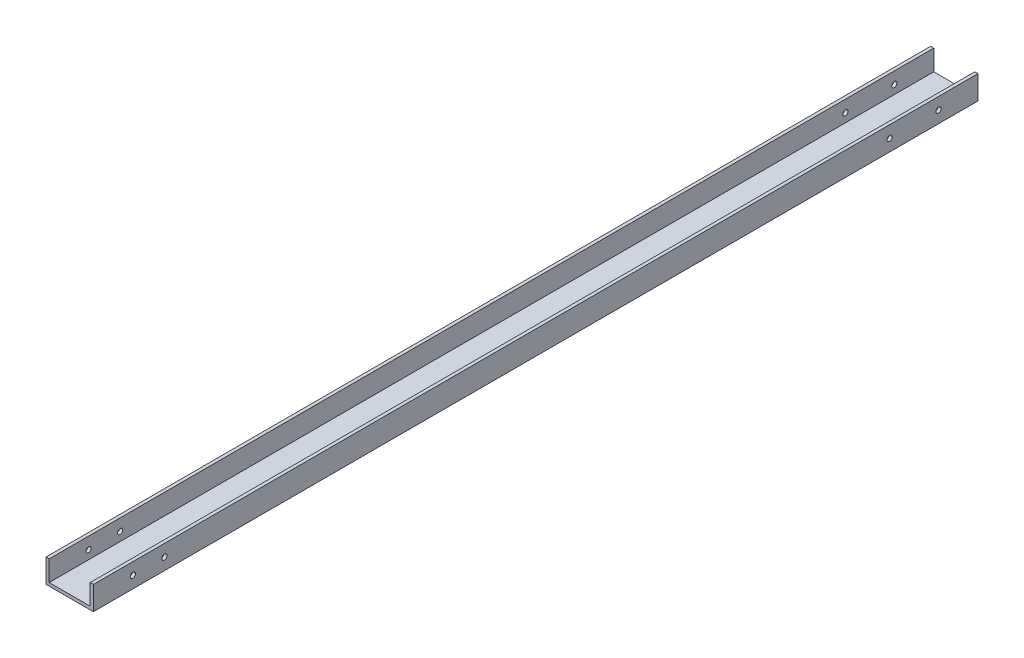
ISO-10303-21;
HEADER;
FILE_DESCRIPTION(('STEP AP214'),'2;1');
FILE_NAME('part.step','',(''),(''),'','','');
FILE_SCHEMA(('AUTOMOTIVE_DESIGN { 1 0 10303 214 1 1 1 1 }'));
ENDSEC;
DATA;
#1=APPLICATION_CONTEXT('core data for automotive mechanical design processes');
#2=APPLICATION_PROTOCOL_DEFINITION('international standard','automotive_design',2000,#1);
#3=PRODUCT_CONTEXT('',#1,'mechanical');
#4=PRODUCT('Part','Part','',(#3));
#5=PRODUCT_RELATED_PRODUCT_CATEGORY('part','',(#4));
#6=PRODUCT_DEFINITION_FORMATION('','',#4);
#7=PRODUCT_DEFINITION_CONTEXT('part definition',#1,'design');
#8=PRODUCT_DEFINITION('design','',#6,#7);
#9=PRODUCT_DEFINITION_SHAPE('','',#8);
#10=(LENGTH_UNIT() NAMED_UNIT(*) SI_UNIT(.MILLI.,.METRE.));
#11=(NAMED_UNIT(*) PLANE_ANGLE_UNIT() SI_UNIT($,.RADIAN.));
#12=(NAMED_UNIT(*) SI_UNIT($,.STERADIAN.) SOLID_ANGLE_UNIT());
#13=UNCERTAINTY_MEASURE_WITH_UNIT(LENGTH_MEASURE(1.E-05),#10,'distance_accuracy_value','');
#14=(GEOMETRIC_REPRESENTATION_CONTEXT(3) GLOBAL_UNCERTAINTY_ASSIGNED_CONTEXT((#13)) GLOBAL_UNIT_ASSIGNED_CONTEXT((#10,
#11,#12)) REPRESENTATION_CONTEXT('',''));
#15=CARTESIAN_POINT('',(0.,0.,0.));
#16=DIRECTION('',(0.,0.,1.));
#17=DIRECTION('',(1.,0.,0.));
#18=AXIS2_PLACEMENT_3D('',#15,#16,#17);
#19=CARTESIAN_POINT('',(-15.,0.,560.3));
#20=DIRECTION('',(1.,0.,0.));
#21=DIRECTION('',(0.,0.,-1.));
#22=AXIS2_PLACEMENT_3D('',#19,#20,#21);
#23=PLANE('',#22);
#24=CARTESIAN_POINT('',(-15.,7.5,25.));
#25=DIRECTION('',(-1.,0.,0.));
#26=DIRECTION('',(0.,0.,1.));
#27=AXIS2_PLACEMENT_3D('',#24,#25,#26);
#28=CIRCLE('',#27,1.64999999999999);
#29=CARTESIAN_POINT('',(-15.,7.5,26.65));
#30=VERTEX_POINT('',#29);
#31=EDGE_CURVE('E219',#30,#30,#28,.T.);
#32=ORIENTED_EDGE('',*,*,#31,.F.);
#33=EDGE_LOOP('',(#32));
#34=FACE_BOUND('',#33,.T.);
#35=CARTESIAN_POINT('',(-15.,7.5,515.3));
#36=DIRECTION('',(-1.,0.,0.));
#37=DIRECTION('',(0.,0.,1.));
#38=AXIS2_PLACEMENT_3D('',#35,#36,#37);
#39=CIRCLE('',#38,1.64999999999999);
#40=CARTESIAN_POINT('',(-15.,7.5,516.95));
#41=VERTEX_POINT('',#40);
#42=EDGE_CURVE('E213',#41,#41,#39,.T.);
#43=ORIENTED_EDGE('',*,*,#42,.F.);
#44=EDGE_LOOP('',(#43));
#45=FACE_BOUND('',#44,.T.);
#46=CARTESIAN_POINT('',(-15.,7.5,535.3));
#47=DIRECTION('',(-1.,0.,0.));
#48=DIRECTION('',(0.,0.,1.));
#49=AXIS2_PLACEMENT_3D('',#46,#47,#48);
#50=CIRCLE('',#49,1.64999999999999);
#51=CARTESIAN_POINT('',(-15.,7.5,536.95));
#52=VERTEX_POINT('',#51);
#53=EDGE_CURVE('E207',#52,#52,#50,.T.);
#54=ORIENTED_EDGE('',*,*,#53,.F.);
#55=EDGE_LOOP('',(#54));
#56=FACE_BOUND('',#55,.T.);
#57=DIRECTION('',(0.,-1.,0.));
#58=VECTOR('',#57,1.);
#59=CARTESIAN_POINT('',(-15.,0.,0.));
#60=LINE('',#59,#58);
#61=CARTESIAN_POINT('',(-15.,15.,0.));
#62=VERTEX_POINT('',#61);
#63=CARTESIAN_POINT('',(-15.,0.,0.));
#64=VERTEX_POINT('',#63);
#65=EDGE_CURVE('E144',#62,#64,#60,.T.);
#66=ORIENTED_EDGE('',*,*,#65,.T.);
#67=DIRECTION('',(0.,0.,-1.));
#68=VECTOR('',#67,1.);
#69=CARTESIAN_POINT('',(-15.,0.,560.3));
#70=LINE('',#69,#68);
#71=CARTESIAN_POINT('',(-15.,0.,560.3));
#72=VERTEX_POINT('',#71);
#73=EDGE_CURVE('E128',#72,#64,#70,.T.);
#74=ORIENTED_EDGE('',*,*,#73,.F.);
#75=DIRECTION('',(0.,-1.,0.));
#76=VECTOR('',#75,1.);
#77=CARTESIAN_POINT('',(-15.,0.,560.3));
#78=LINE('',#77,#76);
#79=CARTESIAN_POINT('',(-15.,15.,560.3));
#80=VERTEX_POINT('',#79);
#81=EDGE_CURVE('E52',#80,#72,#78,.T.);
#82=ORIENTED_EDGE('',*,*,#81,.F.);
#83=DIRECTION('',(0.,0.,-1.));
#84=VECTOR('',#83,1.);
#85=CARTESIAN_POINT('',(-15.,15.,560.3));
#86=LINE('',#85,#84);
#87=EDGE_CURVE('E124',#80,#62,#86,.T.);
#88=ORIENTED_EDGE('',*,*,#87,.T.);
#89=EDGE_LOOP('',(#66,#74,#82,#88));
#90=FACE_BOUND('',#89,.T.);
#91=CARTESIAN_POINT('',(-15.,7.49999999999999,56.));
#92=DIRECTION('',(-1.,0.,0.));
#93=DIRECTION('',(0.,0.,1.));
#94=AXIS2_PLACEMENT_3D('',#91,#92,#93);
#95=CIRCLE('',#94,1.64999999999999);
#96=CARTESIAN_POINT('',(-15.,7.49999999999999,57.65));
#97=VERTEX_POINT('',#96);
#98=EDGE_CURVE('E225',#97,#97,#95,.T.);
#99=ORIENTED_EDGE('',*,*,#98,.F.);
#100=EDGE_LOOP('',(#99));
#101=FACE_BOUND('',#100,.T.);
#102=ADVANCED_FACE('F35',(#34,#45,#56,#90,#101),#23,.F.);
#103=CARTESIAN_POINT('',(0.,0.,560.3));
#104=DIRECTION('',(0.,1.,0.));
#105=DIRECTION('',(0.,0.,1.));
#106=AXIS2_PLACEMENT_3D('',#103,#104,#105);
#107=PLANE('',#106);
#108=DIRECTION('',(1.,0.,0.));
#109=VECTOR('',#108,1.);
#110=CARTESIAN_POINT('',(0.,0.,0.));
#111=LINE('',#110,#109);
#112=CARTESIAN_POINT('',(15.,0.,0.));
#113=VERTEX_POINT('',#112);
#114=EDGE_CURVE('E88',#64,#113,#111,.T.);
#115=ORIENTED_EDGE('',*,*,#114,.T.);
#116=DIRECTION('',(0.,0.,-1.));
#117=VECTOR('',#116,1.);
#118=CARTESIAN_POINT('',(15.,0.,560.3));
#119=LINE('',#118,#117);
#120=CARTESIAN_POINT('',(15.,0.,560.3));
#121=VERTEX_POINT('',#120);
#122=EDGE_CURVE('E11',#121,#113,#119,.T.);
#123=ORIENTED_EDGE('',*,*,#122,.F.);
#124=DIRECTION('',(1.,0.,0.));
#125=VECTOR('',#124,1.);
#126=CARTESIAN_POINT('',(0.,0.,560.3));
#127=LINE('',#126,#125);
#128=EDGE_CURVE('E94',#72,#121,#127,.T.);
#129=ORIENTED_EDGE('',*,*,#128,.F.);
#130=ORIENTED_EDGE('',*,*,#73,.T.);
#131=EDGE_LOOP('',(#115,#123,#129,#130));
#132=FACE_BOUND('',#131,.T.);
#133=ADVANCED_FACE('F37',(#132),#107,.F.);
#134=CARTESIAN_POINT('',(15.,0.,560.3));
#135=DIRECTION('',(-1.,0.,0.));
#136=DIRECTION('',(0.,0.,1.));
#137=AXIS2_PLACEMENT_3D('',#134,#135,#136);
#138=PLANE('',#137);
#139=CARTESIAN_POINT('',(15.,7.5,535.3));
#140=DIRECTION('',(1.,0.,0.));
#141=DIRECTION('',(0.,0.,-1.));
#142=AXIS2_PLACEMENT_3D('',#139,#140,#141);
#143=CIRCLE('',#142,1.64999999999999);
#144=CARTESIAN_POINT('',(15.,7.5,533.65));
#145=VERTEX_POINT('',#144);
#146=EDGE_CURVE('E201',#145,#145,#143,.T.);
#147=ORIENTED_EDGE('',*,*,#146,.F.);
#148=EDGE_LOOP('',(#147));
#149=FACE_BOUND('',#148,.T.);
#150=CARTESIAN_POINT('',(15.,7.5,515.3));
#151=DIRECTION('',(1.,0.,0.));
#152=DIRECTION('',(0.,0.,-1.));
#153=AXIS2_PLACEMENT_3D('',#150,#151,#152);
#154=CIRCLE('',#153,1.64999999999999);
#155=CARTESIAN_POINT('',(15.,7.5,513.65));
#156=VERTEX_POINT('',#155);
#157=EDGE_CURVE('E195',#156,#156,#154,.T.);
#158=ORIENTED_EDGE('',*,*,#157,.F.);
#159=EDGE_LOOP('',(#158));
#160=FACE_BOUND('',#159,.T.);
#161=CARTESIAN_POINT('',(15.,7.49999999999999,56.));
#162=DIRECTION('',(1.,0.,0.));
#163=DIRECTION('',(0.,0.,-1.));
#164=AXIS2_PLACEMENT_3D('',#161,#162,#163);
#165=CIRCLE('',#164,1.65);
#166=CARTESIAN_POINT('',(15.,7.49999999999999,54.35));
#167=VERTEX_POINT('',#166);
#168=EDGE_CURVE('E189',#167,#167,#165,.T.);
#169=ORIENTED_EDGE('',*,*,#168,.F.);
#170=EDGE_LOOP('',(#169));
#171=FACE_BOUND('',#170,.T.);
#172=CARTESIAN_POINT('',(15.,7.5,25.));
#173=DIRECTION('',(1.,0.,0.));
#174=DIRECTION('',(0.,0.,-1.));
#175=AXIS2_PLACEMENT_3D('',#172,#173,#174);
#176=CIRCLE('',#175,1.65);
#177=CARTESIAN_POINT('',(15.,7.5,23.35));
#178=VERTEX_POINT('',#177);
#179=EDGE_CURVE('E183',#178,#178,#176,.T.);
#180=ORIENTED_EDGE('',*,*,#179,.F.);
#181=EDGE_LOOP('',(#180));
#182=FACE_BOUND('',#181,.T.);
#183=DIRECTION('',(0.,1.,0.));
#184=VECTOR('',#183,1.);
#185=CARTESIAN_POINT('',(15.,0.,0.));
#186=LINE('',#185,#184);
#187=CARTESIAN_POINT('',(15.,15.,0.));
#188=VERTEX_POINT('',#187);
#189=EDGE_CURVE('E133',#113,#188,#186,.T.);
#190=ORIENTED_EDGE('',*,*,#189,.T.);
#191=DIRECTION('',(0.,0.,-1.));
#192=VECTOR('',#191,1.);
#193=CARTESIAN_POINT('',(15.,15.,560.3));
#194=LINE('',#193,#192);
#195=CARTESIAN_POINT('',(15.,15.,560.3));
#196=VERTEX_POINT('',#195);
#197=EDGE_CURVE('E44',#196,#188,#194,.T.);
#198=ORIENTED_EDGE('',*,*,#197,.F.);
#199=DIRECTION('',(0.,1.,0.));
#200=VECTOR('',#199,1.);
#201=CARTESIAN_POINT('',(15.,0.,560.3));
#202=LINE('',#201,#200);
#203=EDGE_CURVE('E178',#121,#196,#202,.T.);
#204=ORIENTED_EDGE('',*,*,#203,.F.);
#205=ORIENTED_EDGE('',*,*,#122,.T.);
#206=EDGE_LOOP('',(#190,#198,#204,#205));
#207=FACE_BOUND('',#206,.T.);
#208=ADVANCED_FACE('F238',(#149,#160,#171,#182,#207),#138,.F.);
#209=CARTESIAN_POINT('',(15.,15.,560.3));
#210=DIRECTION('',(0.,-1.,0.));
#211=DIRECTION('',(0.,0.,-1.));
#212=AXIS2_PLACEMENT_3D('',#209,#210,#211);
#213=PLANE('',#212);
#214=DIRECTION('',(-1.,0.,0.));
#215=VECTOR('',#214,1.);
#216=CARTESIAN_POINT('',(15.,15.,0.));
#217=LINE('',#216,#215);
#218=CARTESIAN_POINT('',(13.,15.,0.));
#219=VERTEX_POINT('',#218);
#220=EDGE_CURVE('E136',#188,#219,#217,.T.);
#221=ORIENTED_EDGE('',*,*,#220,.T.);
#222=DIRECTION('',(0.,0.,-1.));
#223=VECTOR('',#222,1.);
#224=CARTESIAN_POINT('',(13.,15.,560.3));
#225=LINE('',#224,#223);
#226=CARTESIAN_POINT('',(13.,15.,560.3));
#227=VERTEX_POINT('',#226);
#228=EDGE_CURVE('E153',#227,#219,#225,.T.);
#229=ORIENTED_EDGE('',*,*,#228,.F.);
#230=DIRECTION('',(-1.,0.,0.));
#231=VECTOR('',#230,1.);
#232=CARTESIAN_POINT('',(15.,15.,560.3));
#233=LINE('',#232,#231);
#234=EDGE_CURVE('E162',#196,#227,#233,.T.);
#235=ORIENTED_EDGE('',*,*,#234,.F.);
#236=ORIENTED_EDGE('',*,*,#197,.T.);
#237=EDGE_LOOP('',(#221,#229,#235,#236));
#238=FACE_BOUND('',#237,.T.);
#239=ADVANCED_FACE('F160',(#238),#213,.F.);
#240=CARTESIAN_POINT('',(13.,15.,560.3));
#241=DIRECTION('',(1.,0.,0.));
#242=DIRECTION('',(0.,1.,0.));
#243=AXIS2_PLACEMENT_3D('',#240,#241,#242);
#244=PLANE('',#243);
#245=CARTESIAN_POINT('',(13.,7.5,535.3));
#246=DIRECTION('',(1.,0.,0.));
#247=DIRECTION('',(0.,1.,0.));
#248=AXIS2_PLACEMENT_3D('',#245,#246,#247);
#249=CIRCLE('',#248,1.64999999999999);
#250=CARTESIAN_POINT('',(13.,9.14999999999999,535.3));
#251=VERTEX_POINT('',#250);
#252=EDGE_CURVE('E198',#251,#251,#249,.T.);
#253=ORIENTED_EDGE('',*,*,#252,.T.);
#254=EDGE_LOOP('',(#253));
#255=FACE_BOUND('',#254,.T.);
#256=CARTESIAN_POINT('',(13.,7.5,515.3));
#257=DIRECTION('',(1.,0.,0.));
#258=DIRECTION('',(0.,1.,0.));
#259=AXIS2_PLACEMENT_3D('',#256,#257,#258);
#260=CIRCLE('',#259,1.64999999999999);
#261=CARTESIAN_POINT('',(13.,9.14999999999999,515.3));
#262=VERTEX_POINT('',#261);
#263=EDGE_CURVE('E192',#262,#262,#260,.T.);
#264=ORIENTED_EDGE('',*,*,#263,.T.);
#265=EDGE_LOOP('',(#264));
#266=FACE_BOUND('',#265,.T.);
#267=CARTESIAN_POINT('',(13.,7.49999999999999,56.));
#268=DIRECTION('',(1.,0.,0.));
#269=DIRECTION('',(0.,1.,0.));
#270=AXIS2_PLACEMENT_3D('',#267,#268,#269);
#271=CIRCLE('',#270,1.65);
#272=CARTESIAN_POINT('',(13.,9.14999999999999,56.));
#273=VERTEX_POINT('',#272);
#274=EDGE_CURVE('E186',#273,#273,#271,.T.);
#275=ORIENTED_EDGE('',*,*,#274,.T.);
#276=EDGE_LOOP('',(#275));
#277=FACE_BOUND('',#276,.T.);
#278=CARTESIAN_POINT('',(13.,7.5,25.));
#279=DIRECTION('',(1.,0.,0.));
#280=DIRECTION('',(0.,1.,0.));
#281=AXIS2_PLACEMENT_3D('',#278,#279,#280);
#282=CIRCLE('',#281,1.65);
#283=CARTESIAN_POINT('',(13.,9.15,25.));
#284=VERTEX_POINT('',#283);
#285=EDGE_CURVE('E134',#284,#284,#282,.T.);
#286=ORIENTED_EDGE('',*,*,#285,.T.);
#287=EDGE_LOOP('',(#286));
#288=FACE_BOUND('',#287,.T.);
#289=DIRECTION('',(0.,-1.,0.));
#290=VECTOR('',#289,1.);
#291=CARTESIAN_POINT('',(13.,15.,0.));
#292=LINE('',#291,#290);
#293=CARTESIAN_POINT('',(13.,2.,0.));
#294=VERTEX_POINT('',#293);
#295=EDGE_CURVE('E138',#219,#294,#292,.T.);
#296=ORIENTED_EDGE('',*,*,#295,.T.);
#297=DIRECTION('',(0.,0.,-1.));
#298=VECTOR('',#297,1.);
#299=CARTESIAN_POINT('',(13.,2.,560.3));
#300=LINE('',#299,#298);
#301=CARTESIAN_POINT('',(13.,2.,560.3));
#302=VERTEX_POINT('',#301);
#303=EDGE_CURVE('E150',#302,#294,#300,.T.);
#304=ORIENTED_EDGE('',*,*,#303,.F.);
#305=DIRECTION('',(0.,-1.,0.));
#306=VECTOR('',#305,1.);
#307=CARTESIAN_POINT('',(13.,15.,560.3));
#308=LINE('',#307,#306);
#309=EDGE_CURVE('E174',#227,#302,#308,.T.);
#310=ORIENTED_EDGE('',*,*,#309,.F.);
#311=ORIENTED_EDGE('',*,*,#228,.T.);
#312=EDGE_LOOP('',(#296,#304,#310,#311));
#313=FACE_BOUND('',#312,.T.);
#314=ADVANCED_FACE('F170',(#255,#266,#277,#288,#313),#244,.F.);
#315=CARTESIAN_POINT('',(-13.,2.,560.3));
#316=DIRECTION('',(0.,-1.,0.));
#317=DIRECTION('',(1.,0.,0.));
#318=AXIS2_PLACEMENT_3D('',#315,#316,#317);
#319=PLANE('',#318);
#320=DIRECTION('',(-1.,0.,0.));
#321=VECTOR('',#320,1.);
#322=CARTESIAN_POINT('',(-13.,2.,0.));
#323=LINE('',#322,#321);
#324=CARTESIAN_POINT('',(-13.,2.,0.));
#325=VERTEX_POINT('',#324);
#326=EDGE_CURVE('E140',#294,#325,#323,.T.);
#327=ORIENTED_EDGE('',*,*,#326,.T.);
#328=DIRECTION('',(0.,0.,-1.));
#329=VECTOR('',#328,1.);
#330=CARTESIAN_POINT('',(-13.,2.,560.3));
#331=LINE('',#330,#329);
#332=CARTESIAN_POINT('',(-13.,2.,560.3));
#333=VERTEX_POINT('',#332);
#334=EDGE_CURVE('E123',#333,#325,#331,.T.);
#335=ORIENTED_EDGE('',*,*,#334,.F.);
#336=DIRECTION('',(-1.,0.,0.));
#337=VECTOR('',#336,1.);
#338=CARTESIAN_POINT('',(-13.,2.,560.3));
#339=LINE('',#338,#337);
#340=EDGE_CURVE('E114',#302,#333,#339,.T.);
#341=ORIENTED_EDGE('',*,*,#340,.F.);
#342=ORIENTED_EDGE('',*,*,#303,.T.);
#343=EDGE_LOOP('',(#327,#335,#341,#342));
#344=FACE_BOUND('',#343,.T.);
#345=ADVANCED_FACE('F173',(#344),#319,.F.);
#346=CARTESIAN_POINT('',(-13.,15.,560.3));
#347=DIRECTION('',(-1.,0.,0.));
#348=DIRECTION('',(0.,0.,1.));
#349=AXIS2_PLACEMENT_3D('',#346,#347,#348);
#350=PLANE('',#349);
#351=CARTESIAN_POINT('',(-13.,7.49999999999999,56.));
#352=DIRECTION('',(-1.,0.,0.));
#353=DIRECTION('',(0.,0.,1.));
#354=AXIS2_PLACEMENT_3D('',#351,#352,#353);
#355=CIRCLE('',#354,1.64999999999999);
#356=CARTESIAN_POINT('',(-13.,7.49999999999999,57.65));
#357=VERTEX_POINT('',#356);
#358=EDGE_CURVE('E222',#357,#357,#355,.T.);
#359=ORIENTED_EDGE('',*,*,#358,.T.);
#360=EDGE_LOOP('',(#359));
#361=FACE_BOUND('',#360,.T.);
#362=CARTESIAN_POINT('',(-13.,7.5,25.));
#363=DIRECTION('',(-1.,0.,0.));
#364=DIRECTION('',(0.,0.,1.));
#365=AXIS2_PLACEMENT_3D('',#362,#363,#364);
#366=CIRCLE('',#365,1.64999999999999);
#367=CARTESIAN_POINT('',(-13.,7.5,26.65));
#368=VERTEX_POINT('',#367);
#369=EDGE_CURVE('E216',#368,#368,#366,.T.);
#370=ORIENTED_EDGE('',*,*,#369,.T.);
#371=EDGE_LOOP('',(#370));
#372=FACE_BOUND('',#371,.T.);
#373=CARTESIAN_POINT('',(-13.,7.5,515.3));
#374=DIRECTION('',(-1.,0.,0.));
#375=DIRECTION('',(0.,0.,1.));
#376=AXIS2_PLACEMENT_3D('',#373,#374,#375);
#377=CIRCLE('',#376,1.64999999999999);
#378=CARTESIAN_POINT('',(-13.,7.5,516.95));
#379=VERTEX_POINT('',#378);
#380=EDGE_CURVE('E210',#379,#379,#377,.T.);
#381=ORIENTED_EDGE('',*,*,#380,.T.);
#382=EDGE_LOOP('',(#381));
#383=FACE_BOUND('',#382,.T.);
#384=CARTESIAN_POINT('',(-13.,7.5,535.3));
#385=DIRECTION('',(-1.,0.,0.));
#386=DIRECTION('',(0.,0.,1.));
#387=AXIS2_PLACEMENT_3D('',#384,#385,#386);
#388=CIRCLE('',#387,1.64999999999999);
#389=CARTESIAN_POINT('',(-13.,7.5,536.95));
#390=VERTEX_POINT('',#389);
#391=EDGE_CURVE('E204',#390,#390,#388,.T.);
#392=ORIENTED_EDGE('',*,*,#391,.T.);
#393=EDGE_LOOP('',(#392));
#394=FACE_BOUND('',#393,.T.);
#395=DIRECTION('',(0.,1.,0.));
#396=VECTOR('',#395,1.);
#397=CARTESIAN_POINT('',(-13.,15.,0.));
#398=LINE('',#397,#396);
#399=CARTESIAN_POINT('',(-13.,15.,0.));
#400=VERTEX_POINT('',#399);
#401=EDGE_CURVE('E122',#325,#400,#398,.T.);
#402=ORIENTED_EDGE('',*,*,#401,.T.);
#403=DIRECTION('',(0.,0.,-1.));
#404=VECTOR('',#403,1.);
#405=CARTESIAN_POINT('',(-13.,15.,560.3));
#406=LINE('',#405,#404);
#407=CARTESIAN_POINT('',(-13.,15.,560.3));
#408=VERTEX_POINT('',#407);
#409=EDGE_CURVE('E119',#408,#400,#406,.T.);
#410=ORIENTED_EDGE('',*,*,#409,.F.);
#411=DIRECTION('',(0.,1.,0.));
#412=VECTOR('',#411,1.);
#413=CARTESIAN_POINT('',(-13.,15.,560.3));
#414=LINE('',#413,#412);
#415=EDGE_CURVE('E108',#333,#408,#414,.T.);
#416=ORIENTED_EDGE('',*,*,#415,.F.);
#417=ORIENTED_EDGE('',*,*,#334,.T.);
#418=EDGE_LOOP('',(#402,#410,#416,#417));
#419=FACE_BOUND('',#418,.T.);
#420=ADVANCED_FACE('F120',(#361,#372,#383,#394,#419),#350,.F.);
#421=CARTESIAN_POINT('',(-15.,15.,560.3));
#422=DIRECTION('',(0.,-1.,0.));
#423=DIRECTION('',(0.,0.,-1.));
#424=AXIS2_PLACEMENT_3D('',#421,#422,#423);
#425=PLANE('',#424);
#426=DIRECTION('',(-1.,0.,0.));
#427=VECTOR('',#426,1.);
#428=CARTESIAN_POINT('',(-15.,15.,0.));
#429=LINE('',#428,#427);
#430=EDGE_CURVE('E81',#400,#62,#429,.T.);
#431=ORIENTED_EDGE('',*,*,#430,.T.);
#432=ORIENTED_EDGE('',*,*,#87,.F.);
#433=DIRECTION('',(-1.,0.,0.));
#434=VECTOR('',#433,1.);
#435=CARTESIAN_POINT('',(-15.,15.,560.3));
#436=LINE('',#435,#434);
#437=EDGE_CURVE('E112',#408,#80,#436,.T.);
#438=ORIENTED_EDGE('',*,*,#437,.F.);
#439=ORIENTED_EDGE('',*,*,#409,.T.);
#440=EDGE_LOOP('',(#431,#432,#438,#439));
#441=FACE_BOUND('',#440,.T.);
#442=ADVANCED_FACE('F126',(#441),#425,.F.);
#443=CARTESIAN_POINT('',(0.,0.,560.3));
#444=DIRECTION('',(0.,0.,-1.));
#445=DIRECTION('',(-1.,0.,0.));
#446=AXIS2_PLACEMENT_3D('',#443,#444,#445);
#447=PLANE('',#446);
#448=ORIENTED_EDGE('',*,*,#128,.T.);
#449=ORIENTED_EDGE('',*,*,#203,.T.);
#450=ORIENTED_EDGE('',*,*,#234,.T.);
#451=ORIENTED_EDGE('',*,*,#309,.T.);
#452=ORIENTED_EDGE('',*,*,#340,.T.);
#453=ORIENTED_EDGE('',*,*,#415,.T.);
#454=ORIENTED_EDGE('',*,*,#437,.T.);
#455=ORIENTED_EDGE('',*,*,#81,.T.);
#456=EDGE_LOOP('',(#448,#449,#450,#451,#452,#453,#454,#455));
#457=FACE_BOUND('',#456,.T.);
#458=ADVANCED_FACE('F110',(#457),#447,.F.);
#459=CARTESIAN_POINT('',(0.,0.,0.));
#460=DIRECTION('',(0.,0.,-1.));
#461=DIRECTION('',(-1.,0.,0.));
#462=AXIS2_PLACEMENT_3D('',#459,#460,#461);
#463=PLANE('',#462);
#464=ORIENTED_EDGE('',*,*,#114,.F.);
#465=ORIENTED_EDGE('',*,*,#65,.F.);
#466=ORIENTED_EDGE('',*,*,#430,.F.);
#467=ORIENTED_EDGE('',*,*,#401,.F.);
#468=ORIENTED_EDGE('',*,*,#326,.F.);
#469=ORIENTED_EDGE('',*,*,#295,.F.);
#470=ORIENTED_EDGE('',*,*,#220,.F.);
#471=ORIENTED_EDGE('',*,*,#189,.F.);
#472=EDGE_LOOP('',(#464,#465,#466,#467,#468,#469,#470,#471));
#473=FACE_BOUND('',#472,.T.);
#474=ADVANCED_FACE('F166',(#473),#463,.T.);
#475=CARTESIAN_POINT('',(15.,7.5,25.));
#476=DIRECTION('',(1.,0.,0.));
#477=DIRECTION('',(0.,0.,-1.));
#478=AXIS2_PLACEMENT_3D('',#475,#476,#477);
#479=CYLINDRICAL_SURFACE('',#478,1.65);
#480=ORIENTED_EDGE('',*,*,#179,.T.);
#481=EDGE_LOOP('',(#480));
#482=FACE_BOUND('',#481,.T.);
#483=ORIENTED_EDGE('',*,*,#285,.F.);
#484=EDGE_LOOP('',(#483));
#485=FACE_BOUND('',#484,.T.);
#486=ADVANCED_FACE('F269',(#482,#485),#479,.F.);
#487=CARTESIAN_POINT('',(15.,7.49999999999999,56.));
#488=DIRECTION('',(1.,0.,0.));
#489=DIRECTION('',(0.,0.,-1.));
#490=AXIS2_PLACEMENT_3D('',#487,#488,#489);
#491=CYLINDRICAL_SURFACE('',#490,1.65);
#492=ORIENTED_EDGE('',*,*,#168,.T.);
#493=EDGE_LOOP('',(#492));
#494=FACE_BOUND('',#493,.T.);
#495=ORIENTED_EDGE('',*,*,#274,.F.);
#496=EDGE_LOOP('',(#495));
#497=FACE_BOUND('',#496,.T.);
#498=ADVANCED_FACE('F272',(#494,#497),#491,.F.);
#499=CARTESIAN_POINT('',(15.,7.5,515.3));
#500=DIRECTION('',(1.,0.,0.));
#501=DIRECTION('',(0.,0.,-1.));
#502=AXIS2_PLACEMENT_3D('',#499,#500,#501);
#503=CYLINDRICAL_SURFACE('',#502,1.64999999999999);
#504=ORIENTED_EDGE('',*,*,#157,.T.);
#505=EDGE_LOOP('',(#504));
#506=FACE_BOUND('',#505,.T.);
#507=ORIENTED_EDGE('',*,*,#263,.F.);
#508=EDGE_LOOP('',(#507));
#509=FACE_BOUND('',#508,.T.);
#510=ADVANCED_FACE('F280',(#506,#509),#503,.F.);
#511=CARTESIAN_POINT('',(15.,7.5,535.3));
#512=DIRECTION('',(1.,0.,0.));
#513=DIRECTION('',(0.,0.,-1.));
#514=AXIS2_PLACEMENT_3D('',#511,#512,#513);
#515=CYLINDRICAL_SURFACE('',#514,1.64999999999999);
#516=ORIENTED_EDGE('',*,*,#146,.T.);
#517=EDGE_LOOP('',(#516));
#518=FACE_BOUND('',#517,.T.);
#519=ORIENTED_EDGE('',*,*,#252,.F.);
#520=EDGE_LOOP('',(#519));
#521=FACE_BOUND('',#520,.T.);
#522=ADVANCED_FACE('F330',(#518,#521),#515,.F.);
#523=CARTESIAN_POINT('',(-15.,7.5,535.3));
#524=DIRECTION('',(-1.,0.,0.));
#525=DIRECTION('',(0.,0.,1.));
#526=AXIS2_PLACEMENT_3D('',#523,#524,#525);
#527=CYLINDRICAL_SURFACE('',#526,1.64999999999999);
#528=ORIENTED_EDGE('',*,*,#53,.T.);
#529=EDGE_LOOP('',(#528));
#530=FACE_BOUND('',#529,.T.);
#531=ORIENTED_EDGE('',*,*,#391,.F.);
#532=EDGE_LOOP('',(#531));
#533=FACE_BOUND('',#532,.T.);
#534=ADVANCED_FACE('F339',(#530,#533),#527,.F.);
#535=CARTESIAN_POINT('',(-15.,7.5,515.3));
#536=DIRECTION('',(-1.,0.,0.));
#537=DIRECTION('',(0.,0.,1.));
#538=AXIS2_PLACEMENT_3D('',#535,#536,#537);
#539=CYLINDRICAL_SURFACE('',#538,1.64999999999999);
#540=ORIENTED_EDGE('',*,*,#42,.T.);
#541=EDGE_LOOP('',(#540));
#542=FACE_BOUND('',#541,.T.);
#543=ORIENTED_EDGE('',*,*,#380,.F.);
#544=EDGE_LOOP('',(#543));
#545=FACE_BOUND('',#544,.T.);
#546=ADVANCED_FACE('F362',(#542,#545),#539,.F.);
#547=CARTESIAN_POINT('',(-15.,7.5,25.));
#548=DIRECTION('',(-1.,0.,0.));
#549=DIRECTION('',(0.,0.,1.));
#550=AXIS2_PLACEMENT_3D('',#547,#548,#549);
#551=CYLINDRICAL_SURFACE('',#550,1.64999999999999);
#552=ORIENTED_EDGE('',*,*,#31,.T.);
#553=EDGE_LOOP('',(#552));
#554=FACE_BOUND('',#553,.T.);
#555=ORIENTED_EDGE('',*,*,#369,.F.);
#556=EDGE_LOOP('',(#555));
#557=FACE_BOUND('',#556,.T.);
#558=ADVANCED_FACE('F373',(#554,#557),#551,.F.);
#559=CARTESIAN_POINT('',(-15.,7.49999999999999,56.));
#560=DIRECTION('',(-1.,0.,0.));
#561=DIRECTION('',(0.,0.,1.));
#562=AXIS2_PLACEMENT_3D('',#559,#560,#561);
#563=CYLINDRICAL_SURFACE('',#562,1.64999999999999);
#564=ORIENTED_EDGE('',*,*,#98,.T.);
#565=EDGE_LOOP('',(#564));
#566=FACE_BOUND('',#565,.T.);
#567=ORIENTED_EDGE('',*,*,#358,.F.);
#568=EDGE_LOOP('',(#567));
#569=FACE_BOUND('',#568,.T.);
#570=ADVANCED_FACE('F229',(#566,#569),#563,.F.);
#571=CLOSED_SHELL('',(#102,#133,#208,#239,#314,#345,#420,#442,#458,#474,#486,#498,#510,#522,
#534,#546,#558,#570));
#572=MANIFOLD_SOLID_BREP('B2',#571);
#573=ADVANCED_BREP_SHAPE_REPRESENTATION('',(#18,#572),#14);
#574=SHAPE_DEFINITION_REPRESENTATION(#9,#573);
ENDSEC;
END-ISO-10303-21;
